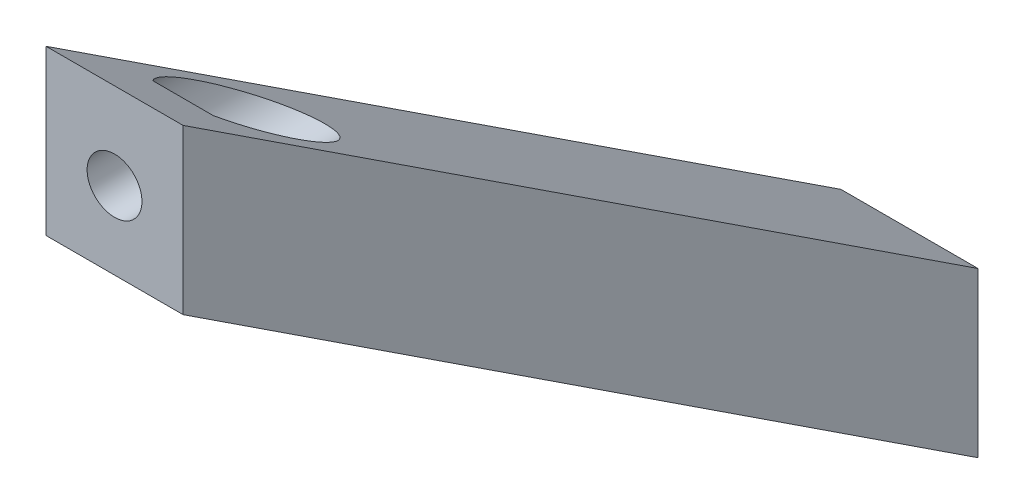
ISO-10303-21;
HEADER;
FILE_DESCRIPTION(('STEP AP214'),'2;1');
FILE_NAME('part.step','',(''),(''),'','','');
FILE_SCHEMA(('AUTOMOTIVE_DESIGN { 1 0 10303 214 1 1 1 1 }'));
ENDSEC;
DATA;
#1=APPLICATION_CONTEXT('core data for automotive mechanical design processes');
#2=APPLICATION_PROTOCOL_DEFINITION('international standard','automotive_design',2000,#1);
#3=PRODUCT_CONTEXT('',#1,'mechanical');
#4=PRODUCT('Part','Part','',(#3));
#5=PRODUCT_RELATED_PRODUCT_CATEGORY('part','',(#4));
#6=PRODUCT_DEFINITION_FORMATION('','',#4);
#7=PRODUCT_DEFINITION_CONTEXT('part definition',#1,'design');
#8=PRODUCT_DEFINITION('design','',#6,#7);
#9=PRODUCT_DEFINITION_SHAPE('','',#8);
#10=(LENGTH_UNIT() NAMED_UNIT(*) SI_UNIT(.MILLI.,.METRE.));
#11=(NAMED_UNIT(*) PLANE_ANGLE_UNIT() SI_UNIT($,.RADIAN.));
#12=(NAMED_UNIT(*) SI_UNIT($,.STERADIAN.) SOLID_ANGLE_UNIT());
#13=UNCERTAINTY_MEASURE_WITH_UNIT(LENGTH_MEASURE(1.E-05),#10,'distance_accuracy_value','');
#14=(GEOMETRIC_REPRESENTATION_CONTEXT(3) GLOBAL_UNCERTAINTY_ASSIGNED_CONTEXT((#13)) GLOBAL_UNIT_ASSIGNED_CONTEXT((#10,
#11,#12)) REPRESENTATION_CONTEXT('',''));
#15=CARTESIAN_POINT('',(0.,0.,0.));
#16=DIRECTION('',(0.,0.,1.));
#17=DIRECTION('',(1.,0.,0.));
#18=AXIS2_PLACEMENT_3D('',#15,#16,#17);
#19=CARTESIAN_POINT('',(20.,86.9088255212206,-57.0016956249081));
#20=DIRECTION('',(0.,0.836190087294634,-0.548439730426409));
#21=DIRECTION('',(0.,0.548439730426409,0.836190087294634));
#22=AXIS2_PLACEMENT_3D('',#19,#20,#21);
#23=PLANE('',#22);
#24=CARTESIAN_POINT('',(10.,111.680172570983,-19.2335440800852));
#25=DIRECTION('',(0.,0.836190087294634,-0.548439730426409));
#26=DIRECTION('',(0.,0.548439730426409,0.836190087294634));
#27=AXIS2_PLACEMENT_3D('',#24,#25,#26);
#28=ELLIPSE('',#27,13.6751580600639,7.5);
#29=CARTESIAN_POINT('',(14.4242257973721,117.736262571459,-10.));
#30=VERTEX_POINT('',#29);
#31=CARTESIAN_POINT('',(5.57577420262789,117.736262571459,-10.));
#32=VERTEX_POINT('',#31);
#33=EDGE_CURVE('E49',#30,#32,#28,.T.);
#34=ORIENTED_EDGE('',*,*,#33,.F.);
#35=DIRECTION('',(1.,0.,0.));
#36=VECTOR('',#35,1.);
#37=CARTESIAN_POINT('',(20.,117.736262571459,-10.));
#38=LINE('',#37,#36);
#39=EDGE_CURVE('E157',#32,#30,#38,.T.);
#40=ORIENTED_EDGE('',*,*,#39,.F.);
#41=EDGE_LOOP('',(#34,#40));
#42=FACE_BOUND('',#41,.T.);
#43=DIRECTION('',(0.,-0.548439730426409,-0.836190087294634));
#44=VECTOR('',#43,1.);
#45=CARTESIAN_POINT('',(0.,86.9088255212206,-57.0016956249081));
#46=LINE('',#45,#44);
#47=CARTESIAN_POINT('',(0.,124.295055108701,0.));
#48=VERTEX_POINT('',#47);
#49=CARTESIAN_POINT('',(0.,48.2130616766899,-116.));
#50=VERTEX_POINT('',#49);
#51=EDGE_CURVE('E136',#48,#50,#46,.T.);
#52=ORIENTED_EDGE('',*,*,#51,.F.);
#53=DIRECTION('',(-1.,0.,0.));
#54=VECTOR('',#53,1.);
#55=CARTESIAN_POINT('',(20.,124.295055108701,0.));
#56=LINE('',#55,#54);
#57=CARTESIAN_POINT('',(20.,124.295055108701,0.));
#58=VERTEX_POINT('',#57);
#59=EDGE_CURVE('E150',#58,#48,#56,.T.);
#60=ORIENTED_EDGE('',*,*,#59,.F.);
#61=DIRECTION('',(0.,-0.548439730426409,-0.836190087294634));
#62=VECTOR('',#61,1.);
#63=CARTESIAN_POINT('',(20.,86.9088255212206,-57.0016956249081));
#64=LINE('',#63,#62);
#65=CARTESIAN_POINT('',(20.,48.2130616766899,-116.));
#66=VERTEX_POINT('',#65);
#67=EDGE_CURVE('E138',#58,#66,#64,.T.);
#68=ORIENTED_EDGE('',*,*,#67,.T.);
#69=DIRECTION('',(-1.,0.,0.));
#70=VECTOR('',#69,1.);
#71=CARTESIAN_POINT('',(20.,48.2130616766899,-116.));
#72=LINE('',#71,#70);
#73=EDGE_CURVE('E132',#66,#50,#72,.T.);
#74=ORIENTED_EDGE('',*,*,#73,.T.);
#75=EDGE_LOOP('',(#52,#60,#68,#74));
#76=FACE_BOUND('',#75,.T.);
#77=ADVANCED_FACE('F41',(#42,#76),#23,.T.);
#78=CARTESIAN_POINT('',(20.,0.,0.));
#79=DIRECTION('',(0.,0.,-1.));
#80=DIRECTION('',(0.,1.,0.));
#81=AXIS2_PLACEMENT_3D('',#78,#79,#80);
#82=PLANE('',#81);
#83=CARTESIAN_POINT('',(10.,111.680172570983,0.));
#84=DIRECTION('',(0.,0.,1.));
#85=DIRECTION('',(1.,0.,0.));
#86=AXIS2_PLACEMENT_3D('',#83,#84,#85);
#87=CIRCLE('',#86,4.);
#88=CARTESIAN_POINT('',(14.,111.680172570983,0.));
#89=VERTEX_POINT('',#88);
#90=EDGE_CURVE('E183',#89,#89,#87,.T.);
#91=ORIENTED_EDGE('',*,*,#90,.F.);
#92=EDGE_LOOP('',(#91));
#93=FACE_BOUND('',#92,.T.);
#94=DIRECTION('',(0.,-1.,0.));
#95=VECTOR('',#94,1.);
#96=CARTESIAN_POINT('',(0.,0.,0.));
#97=LINE('',#96,#95);
#98=CARTESIAN_POINT('',(0.,100.377048540713,0.));
#99=VERTEX_POINT('',#98);
#100=EDGE_CURVE('E124',#48,#99,#97,.T.);
#101=ORIENTED_EDGE('',*,*,#100,.T.);
#102=DIRECTION('',(-1.,0.,0.));
#103=VECTOR('',#102,1.);
#104=CARTESIAN_POINT('',(20.,100.377048540713,0.));
#105=LINE('',#104,#103);
#106=CARTESIAN_POINT('',(20.,100.377048540713,0.));
#107=VERTEX_POINT('',#106);
#108=EDGE_CURVE('E118',#107,#99,#105,.T.);
#109=ORIENTED_EDGE('',*,*,#108,.F.);
#110=DIRECTION('',(0.,-1.,0.));
#111=VECTOR('',#110,1.);
#112=CARTESIAN_POINT('',(20.,0.,0.));
#113=LINE('',#112,#111);
#114=EDGE_CURVE('E142',#58,#107,#113,.T.);
#115=ORIENTED_EDGE('',*,*,#114,.F.);
#116=ORIENTED_EDGE('',*,*,#59,.T.);
#117=EDGE_LOOP('',(#101,#109,#115,#116));
#118=FACE_BOUND('',#117,.T.);
#119=ADVANCED_FACE('F107',(#93,#118),#82,.F.);
#120=CARTESIAN_POINT('',(20.,70.1850237753279,-46.0329010163799));
#121=DIRECTION('',(0.,0.836190087294634,-0.548439730426409));
#122=DIRECTION('',(0.,0.548439730426409,0.836190087294634));
#123=AXIS2_PLACEMENT_3D('',#120,#121,#122);
#124=PLANE('',#123);
#125=DIRECTION('',(-1.,0.,0.));
#126=VECTOR('',#125,1.);
#127=CARTESIAN_POINT('',(20.,30.8538476459438,-106.));
#128=LINE('',#127,#126);
#129=CARTESIAN_POINT('',(14.4242257973723,30.8538476459438,-106.));
#130=VERTEX_POINT('',#129);
#131=CARTESIAN_POINT('',(5.57577420262774,30.8538476459438,-106.));
#132=VERTEX_POINT('',#131);
#133=EDGE_CURVE('E92',#130,#132,#128,.T.);
#134=ORIENTED_EDGE('',*,*,#133,.T.);
#135=CARTESIAN_POINT('',(10.,36.9099376464198,-96.7664559199149));
#136=DIRECTION('',(0.,0.836190087294634,-0.548439730426409));
#137=DIRECTION('',(0.,-0.548439730426409,-0.836190087294634));
#138=AXIS2_PLACEMENT_3D('',#135,#136,#137);
#139=ELLIPSE('',#138,13.675158060064,7.5);
#140=EDGE_CURVE('E11',#132,#130,#139,.T.);
#141=ORIENTED_EDGE('',*,*,#140,.T.);
#142=EDGE_LOOP('',(#134,#141));
#143=FACE_BOUND('',#142,.T.);
#144=DIRECTION('',(0.,-0.548439730426409,-0.836190087294634));
#145=VECTOR('',#144,1.);
#146=CARTESIAN_POINT('',(0.,70.1850237753279,-46.0329010163799));
#147=LINE('',#146,#145);
#148=CARTESIAN_POINT('',(0.,24.2950551087014,-116.));
#149=VERTEX_POINT('',#148);
#150=EDGE_CURVE('E112',#99,#149,#147,.T.);
#151=ORIENTED_EDGE('',*,*,#150,.T.);
#152=DIRECTION('',(-1.,0.,0.));
#153=VECTOR('',#152,1.);
#154=CARTESIAN_POINT('',(20.,24.2950551087014,-116.));
#155=LINE('',#154,#153);
#156=CARTESIAN_POINT('',(20.,24.2950551087014,-116.));
#157=VERTEX_POINT('',#156);
#158=EDGE_CURVE('E115',#157,#149,#155,.T.);
#159=ORIENTED_EDGE('',*,*,#158,.F.);
#160=DIRECTION('',(0.,-0.548439730426409,-0.836190087294634));
#161=VECTOR('',#160,1.);
#162=CARTESIAN_POINT('',(20.,70.1850237753279,-46.0329010163799));
#163=LINE('',#162,#161);
#164=EDGE_CURVE('E192',#107,#157,#163,.T.);
#165=ORIENTED_EDGE('',*,*,#164,.F.);
#166=ORIENTED_EDGE('',*,*,#108,.T.);
#167=EDGE_LOOP('',(#151,#159,#165,#166));
#168=FACE_BOUND('',#167,.T.);
#169=ADVANCED_FACE('F103',(#143,#168),#124,.F.);
#170=CARTESIAN_POINT('',(20.,-1.34611835742285E-13,-116.));
#171=DIRECTION('',(0.,0.,1.));
#172=DIRECTION('',(0.,-1.,0.));
#173=AXIS2_PLACEMENT_3D('',#170,#171,#172);
#174=PLANE('',#173);
#175=CARTESIAN_POINT('',(10.,36.9099376464198,-116.));
#176=DIRECTION('',(0.,0.,-1.));
#177=DIRECTION('',(0.,1.,0.));
#178=AXIS2_PLACEMENT_3D('',#175,#176,#177);
#179=CIRCLE('',#178,4.);
#180=CARTESIAN_POINT('',(10.,40.9099376464198,-116.));
#181=VERTEX_POINT('',#180);
#182=EDGE_CURVE('E96',#181,#181,#179,.T.);
#183=ORIENTED_EDGE('',*,*,#182,.F.);
#184=EDGE_LOOP('',(#183));
#185=FACE_BOUND('',#184,.T.);
#186=DIRECTION('',(0.,1.,0.));
#187=VECTOR('',#186,1.);
#188=CARTESIAN_POINT('',(0.,-1.34611835742285E-13,-116.));
#189=LINE('',#188,#187);
#190=EDGE_CURVE('E123',#149,#50,#189,.T.);
#191=ORIENTED_EDGE('',*,*,#190,.T.);
#192=ORIENTED_EDGE('',*,*,#73,.F.);
#193=DIRECTION('',(0.,1.,0.));
#194=VECTOR('',#193,1.);
#195=CARTESIAN_POINT('',(20.,-1.34611835742285E-13,-116.));
#196=LINE('',#195,#194);
#197=EDGE_CURVE('E130',#157,#66,#196,.T.);
#198=ORIENTED_EDGE('',*,*,#197,.F.);
#199=ORIENTED_EDGE('',*,*,#158,.T.);
#200=EDGE_LOOP('',(#191,#192,#198,#199));
#201=FACE_BOUND('',#200,.T.);
#202=ADVANCED_FACE('F106',(#185,#201),#174,.F.);
#203=CARTESIAN_POINT('',(20.,0.,0.));
#204=DIRECTION('',(1.,0.,0.));
#205=DIRECTION('',(0.,0.,-1.));
#206=AXIS2_PLACEMENT_3D('',#203,#204,#205);
#207=PLANE('',#206);
#208=ORIENTED_EDGE('',*,*,#67,.F.);
#209=ORIENTED_EDGE('',*,*,#114,.T.);
#210=ORIENTED_EDGE('',*,*,#164,.T.);
#211=ORIENTED_EDGE('',*,*,#197,.T.);
#212=EDGE_LOOP('',(#208,#209,#210,#211));
#213=FACE_BOUND('',#212,.T.);
#214=ADVANCED_FACE('F206',(#213),#207,.T.);
#215=CARTESIAN_POINT('',(0.,0.,0.));
#216=DIRECTION('',(1.,0.,0.));
#217=DIRECTION('',(0.,0.,-1.));
#218=AXIS2_PLACEMENT_3D('',#215,#216,#217);
#219=PLANE('',#218);
#220=ORIENTED_EDGE('',*,*,#51,.T.);
#221=ORIENTED_EDGE('',*,*,#190,.F.);
#222=ORIENTED_EDGE('',*,*,#150,.F.);
#223=ORIENTED_EDGE('',*,*,#100,.F.);
#224=EDGE_LOOP('',(#220,#221,#222,#223));
#225=FACE_BOUND('',#224,.T.);
#226=ADVANCED_FACE('F134',(#225),#219,.F.);
#227=CARTESIAN_POINT('',(10.,111.680172570983,-116.));
#228=DIRECTION('',(0.,0.,1.));
#229=DIRECTION('',(0.,-1.,0.));
#230=AXIS2_PLACEMENT_3D('',#227,#228,#229);
#231=CYLINDRICAL_SURFACE('',#230,4.);
#232=CARTESIAN_POINT('',(10.,111.680172570983,-9.99999999999999));
#233=DIRECTION('',(0.,0.,1.));
#234=DIRECTION('',(1.,0.,0.));
#235=AXIS2_PLACEMENT_3D('',#232,#233,#234);
#236=CIRCLE('',#235,4.);
#237=CARTESIAN_POINT('',(14.,111.680172570983,-9.99999999999999));
#238=VERTEX_POINT('',#237);
#239=EDGE_CURVE('E153',#238,#238,#236,.F.);
#240=ORIENTED_EDGE('',*,*,#239,.T.);
#241=EDGE_LOOP('',(#240));
#242=FACE_BOUND('',#241,.T.);
#243=ORIENTED_EDGE('',*,*,#90,.T.);
#244=EDGE_LOOP('',(#243));
#245=FACE_BOUND('',#244,.T.);
#246=ADVANCED_FACE('F215',(#242,#245),#231,.F.);
#247=CARTESIAN_POINT('',(10.,111.680172570983,-10.));
#248=DIRECTION('',(0.,0.,1.));
#249=DIRECTION('',(1.,0.,0.));
#250=AXIS2_PLACEMENT_3D('',#247,#248,#249);
#251=PLANE('',#250);
#252=ORIENTED_EDGE('',*,*,#39,.T.);
#253=CARTESIAN_POINT('',(10.,111.680172570983,-10.));
#254=DIRECTION('',(0.,0.,1.));
#255=DIRECTION('',(1.,0.,0.));
#256=AXIS2_PLACEMENT_3D('',#253,#254,#255);
#257=CIRCLE('',#256,7.5);
#258=EDGE_CURVE('E62',#32,#30,#257,.T.);
#259=ORIENTED_EDGE('',*,*,#258,.F.);
#260=EDGE_LOOP('',(#252,#259));
#261=FACE_BOUND('',#260,.T.);
#262=ORIENTED_EDGE('',*,*,#239,.F.);
#263=EDGE_LOOP('',(#262));
#264=FACE_BOUND('',#263,.T.);
#265=ADVANCED_FACE('F219',(#261,#264),#251,.F.);
#266=CARTESIAN_POINT('',(10.,111.680172570983,-116.));
#267=DIRECTION('',(0.,0.,1.));
#268=DIRECTION('',(1.,0.,0.));
#269=AXIS2_PLACEMENT_3D('',#266,#267,#268);
#270=CYLINDRICAL_SURFACE('',#269,7.5);
#271=ORIENTED_EDGE('',*,*,#33,.T.);
#272=ORIENTED_EDGE('',*,*,#258,.T.);
#273=EDGE_LOOP('',(#271,#272));
#274=FACE_BOUND('',#273,.T.);
#275=ADVANCED_FACE('F221',(#274),#270,.F.);
#276=CARTESIAN_POINT('',(10.,36.9099376464199,0.));
#277=DIRECTION('',(0.,0.,-1.));
#278=DIRECTION('',(0.,1.,0.));
#279=AXIS2_PLACEMENT_3D('',#276,#277,#278);
#280=CYLINDRICAL_SURFACE('',#279,4.);
#281=CARTESIAN_POINT('',(10.,36.9099376464198,-106.));
#282=DIRECTION('',(0.,0.,-1.));
#283=DIRECTION('',(0.,1.,0.));
#284=AXIS2_PLACEMENT_3D('',#281,#282,#283);
#285=CIRCLE('',#284,4.);
#286=CARTESIAN_POINT('',(10.,40.9099376464198,-106.));
#287=VERTEX_POINT('',#286);
#288=EDGE_CURVE('E97',#287,#287,#285,.F.);
#289=ORIENTED_EDGE('',*,*,#288,.T.);
#290=EDGE_LOOP('',(#289));
#291=FACE_BOUND('',#290,.T.);
#292=ORIENTED_EDGE('',*,*,#182,.T.);
#293=EDGE_LOOP('',(#292));
#294=FACE_BOUND('',#293,.T.);
#295=ADVANCED_FACE('F163',(#291,#294),#280,.F.);
#296=CARTESIAN_POINT('',(10.,36.9099376464199,1.11022302462516E-13));
#297=DIRECTION('',(0.,0.,-1.));
#298=DIRECTION('',(0.,1.,0.));
#299=AXIS2_PLACEMENT_3D('',#296,#297,#298);
#300=CYLINDRICAL_SURFACE('',#299,7.5);
#301=CARTESIAN_POINT('',(10.,36.9099376464198,-106.));
#302=DIRECTION('',(0.,0.,-1.));
#303=DIRECTION('',(0.,1.,0.));
#304=AXIS2_PLACEMENT_3D('',#301,#302,#303);
#305=CIRCLE('',#304,7.5);
#306=EDGE_CURVE('E55',#132,#130,#305,.T.);
#307=ORIENTED_EDGE('',*,*,#306,.T.);
#308=ORIENTED_EDGE('',*,*,#140,.F.);
#309=EDGE_LOOP('',(#307,#308));
#310=FACE_BOUND('',#309,.T.);
#311=ADVANCED_FACE('F100',(#310),#300,.F.);
#312=CARTESIAN_POINT('',(10.,36.9099376464198,-106.));
#313=DIRECTION('',(0.,0.,-1.));
#314=DIRECTION('',(0.,1.,0.));
#315=AXIS2_PLACEMENT_3D('',#312,#313,#314);
#316=PLANE('',#315);
#317=ORIENTED_EDGE('',*,*,#288,.F.);
#318=EDGE_LOOP('',(#317));
#319=FACE_BOUND('',#318,.T.);
#320=ORIENTED_EDGE('',*,*,#306,.F.);
#321=ORIENTED_EDGE('',*,*,#133,.F.);
#322=EDGE_LOOP('',(#320,#321));
#323=FACE_BOUND('',#322,.T.);
#324=ADVANCED_FACE('F93',(#319,#323),#316,.F.);
#325=CLOSED_SHELL('',(#77,#119,#169,#202,#214,#226,#246,#265,#275,#295,#311,#324));
#326=MANIFOLD_SOLID_BREP('B2',#325);
#327=ADVANCED_BREP_SHAPE_REPRESENTATION('',(#18,#326),#14);
#328=SHAPE_DEFINITION_REPRESENTATION(#9,#327);
ENDSEC;
END-ISO-10303-21;
